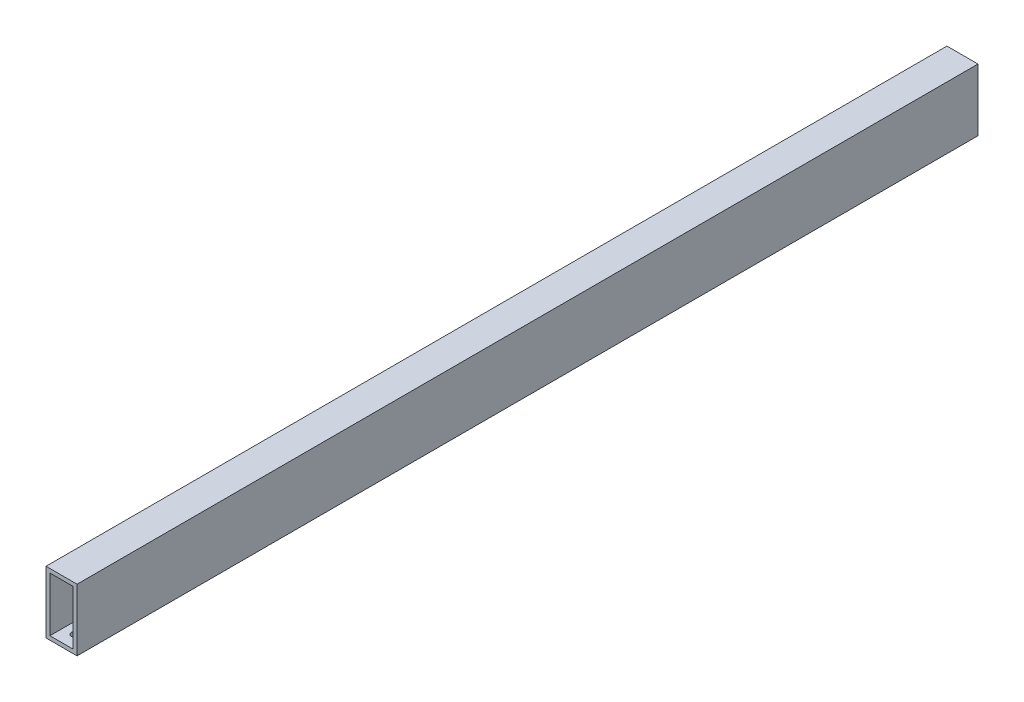
ISO-10303-21;
HEADER;
FILE_DESCRIPTION(('STEP AP214'),'2;1');
FILE_NAME('part.step','',(''),(''),'','','');
FILE_SCHEMA(('AUTOMOTIVE_DESIGN { 1 0 10303 214 1 1 1 1 }'));
ENDSEC;
DATA;
#1=APPLICATION_CONTEXT('core data for automotive mechanical design processes');
#2=APPLICATION_PROTOCOL_DEFINITION('international standard','automotive_design',2000,#1);
#3=PRODUCT_CONTEXT('',#1,'mechanical');
#4=PRODUCT('Part','Part','',(#3));
#5=PRODUCT_RELATED_PRODUCT_CATEGORY('part','',(#4));
#6=PRODUCT_DEFINITION_FORMATION('','',#4);
#7=PRODUCT_DEFINITION_CONTEXT('part definition',#1,'design');
#8=PRODUCT_DEFINITION('design','',#6,#7);
#9=PRODUCT_DEFINITION_SHAPE('','',#8);
#10=(LENGTH_UNIT() NAMED_UNIT(*) SI_UNIT(.MILLI.,.METRE.));
#11=(NAMED_UNIT(*) PLANE_ANGLE_UNIT() SI_UNIT($,.RADIAN.));
#12=(NAMED_UNIT(*) SI_UNIT($,.STERADIAN.) SOLID_ANGLE_UNIT());
#13=UNCERTAINTY_MEASURE_WITH_UNIT(LENGTH_MEASURE(1.E-05),#10,'distance_accuracy_value','');
#14=(GEOMETRIC_REPRESENTATION_CONTEXT(3) GLOBAL_UNCERTAINTY_ASSIGNED_CONTEXT((#13)) GLOBAL_UNIT_ASSIGNED_CONTEXT((#10,
#11,#12)) REPRESENTATION_CONTEXT('',''));
#15=CARTESIAN_POINT('',(0.,0.,0.));
#16=DIRECTION('',(0.,0.,1.));
#17=DIRECTION('',(1.,0.,0.));
#18=AXIS2_PLACEMENT_3D('',#15,#16,#17);
#19=CARTESIAN_POINT('',(0.,0.,736.6));
#20=DIRECTION('',(0.,1.,0.));
#21=DIRECTION('',(0.,0.,1.));
#22=AXIS2_PLACEMENT_3D('',#19,#20,#21);
#23=PLANE('',#22);
#24=CARTESIAN_POINT('',(12.6999999999997,0.,725.17));
#25=DIRECTION('',(0.,-1.,0.));
#26=DIRECTION('',(0.,0.,-1.));
#27=AXIS2_PLACEMENT_3D('',#24,#25,#26);
#28=CIRCLE('',#27,3.17500000000001);
#29=CARTESIAN_POINT('',(12.6999999999997,0.,721.995));
#30=VERTEX_POINT('',#29);
#31=EDGE_CURVE('E228',#30,#30,#28,.F.);
#32=ORIENTED_EDGE('',*,*,#31,.T.);
#33=EDGE_LOOP('',(#32));
#34=FACE_BOUND('',#33,.T.);
#35=CARTESIAN_POINT('',(12.6999999999997,0.,26.0582354721581));
#36=DIRECTION('',(0.,-1.,0.));
#37=DIRECTION('',(0.,0.,-1.));
#38=AXIS2_PLACEMENT_3D('',#35,#36,#37);
#39=CIRCLE('',#38,3.175);
#40=CARTESIAN_POINT('',(12.6999999999997,0.,22.8832354721581));
#41=VERTEX_POINT('',#40);
#42=EDGE_CURVE('E231',#41,#41,#39,.T.);
#43=ORIENTED_EDGE('',*,*,#42,.F.);
#44=EDGE_LOOP('',(#43));
#45=FACE_BOUND('',#44,.T.);
#46=CARTESIAN_POINT('',(12.6999999999997,0.,710.541764527842));
#47=DIRECTION('',(0.,-1.,0.));
#48=DIRECTION('',(0.,0.,-1.));
#49=AXIS2_PLACEMENT_3D('',#46,#47,#48);
#50=CIRCLE('',#49,3.175);
#51=CARTESIAN_POINT('',(12.6999999999997,0.,707.366764527841));
#52=VERTEX_POINT('',#51);
#53=EDGE_CURVE('E237',#52,#52,#50,.F.);
#54=ORIENTED_EDGE('',*,*,#53,.T.);
#55=EDGE_LOOP('',(#54));
#56=FACE_BOUND('',#55,.T.);
#57=DIRECTION('',(1.,0.,0.));
#58=VECTOR('',#57,1.);
#59=CARTESIAN_POINT('',(0.,0.,0.));
#60=LINE('',#59,#58);
#61=CARTESIAN_POINT('',(0.,0.,0.));
#62=VERTEX_POINT('',#61);
#63=CARTESIAN_POINT('',(25.4,0.,0.));
#64=VERTEX_POINT('',#63);
#65=EDGE_CURVE('E178',#62,#64,#60,.T.);
#66=ORIENTED_EDGE('',*,*,#65,.T.);
#67=DIRECTION('',(0.,0.,-1.));
#68=VECTOR('',#67,1.);
#69=CARTESIAN_POINT('',(25.4,0.,736.6));
#70=LINE('',#69,#68);
#71=CARTESIAN_POINT('',(25.4,0.,736.6));
#72=VERTEX_POINT('',#71);
#73=EDGE_CURVE('E51',#72,#64,#70,.T.);
#74=ORIENTED_EDGE('',*,*,#73,.F.);
#75=DIRECTION('',(1.,0.,0.));
#76=VECTOR('',#75,1.);
#77=CARTESIAN_POINT('',(0.,0.,736.6));
#78=LINE('',#77,#76);
#79=CARTESIAN_POINT('',(0.,0.,736.6));
#80=VERTEX_POINT('',#79);
#81=EDGE_CURVE('E164',#80,#72,#78,.T.);
#82=ORIENTED_EDGE('',*,*,#81,.F.);
#83=DIRECTION('',(0.,0.,-1.));
#84=VECTOR('',#83,1.);
#85=CARTESIAN_POINT('',(0.,0.,736.6));
#86=LINE('',#85,#84);
#87=EDGE_CURVE('E11',#80,#62,#86,.T.);
#88=ORIENTED_EDGE('',*,*,#87,.T.);
#89=EDGE_LOOP('',(#66,#74,#82,#88));
#90=FACE_BOUND('',#89,.T.);
#91=CARTESIAN_POINT('',(12.7000000000002,0.,11.4300000000001));
#92=DIRECTION('',(0.,-1.,0.));
#93=DIRECTION('',(0.,0.,-1.));
#94=AXIS2_PLACEMENT_3D('',#91,#92,#93);
#95=CIRCLE('',#94,3.17500000000001);
#96=CARTESIAN_POINT('',(12.7000000000002,0.,8.25500000000004));
#97=VERTEX_POINT('',#96);
#98=EDGE_CURVE('E220',#97,#97,#95,.T.);
#99=ORIENTED_EDGE('',*,*,#98,.F.);
#100=EDGE_LOOP('',(#99));
#101=FACE_BOUND('',#100,.T.);
#102=ADVANCED_FACE('F42',(#34,#45,#56,#90,#101),#23,.F.);
#103=CARTESIAN_POINT('',(3.175,3.175,736.6));
#104=DIRECTION('',(0.,1.,0.));
#105=DIRECTION('',(0.,0.,1.));
#106=AXIS2_PLACEMENT_3D('',#103,#104,#105);
#107=PLANE('',#106);
#108=CARTESIAN_POINT('',(12.6999999999997,3.175,725.17));
#109=DIRECTION('',(0.,1.,0.));
#110=DIRECTION('',(0.,0.,1.));
#111=AXIS2_PLACEMENT_3D('',#108,#109,#110);
#112=CIRCLE('',#111,3.17500000000001);
#113=CARTESIAN_POINT('',(12.6999999999997,3.175,728.345));
#114=VERTEX_POINT('',#113);
#115=EDGE_CURVE('E234',#114,#114,#112,.T.);
#116=ORIENTED_EDGE('',*,*,#115,.F.);
#117=EDGE_LOOP('',(#116));
#118=FACE_BOUND('',#117,.T.);
#119=CARTESIAN_POINT('',(12.6999999999997,3.175,710.541764527842));
#120=DIRECTION('',(0.,1.,0.));
#121=DIRECTION('',(0.,0.,1.));
#122=AXIS2_PLACEMENT_3D('',#119,#120,#121);
#123=CIRCLE('',#122,3.175);
#124=CARTESIAN_POINT('',(12.6999999999997,3.175,713.716764527842));
#125=VERTEX_POINT('',#124);
#126=EDGE_CURVE('E145',#125,#125,#123,.T.);
#127=ORIENTED_EDGE('',*,*,#126,.F.);
#128=EDGE_LOOP('',(#127));
#129=FACE_BOUND('',#128,.T.);
#130=DIRECTION('',(1.,0.,0.));
#131=VECTOR('',#130,1.);
#132=CARTESIAN_POINT('',(3.175,3.175,0.));
#133=LINE('',#132,#131);
#134=CARTESIAN_POINT('',(3.175,3.175,0.));
#135=VERTEX_POINT('',#134);
#136=CARTESIAN_POINT('',(22.225,3.175,0.));
#137=VERTEX_POINT('',#136);
#138=EDGE_CURVE('E66',#135,#137,#133,.T.);
#139=ORIENTED_EDGE('',*,*,#138,.F.);
#140=DIRECTION('',(0.,0.,-1.));
#141=VECTOR('',#140,1.);
#142=CARTESIAN_POINT('',(3.175,3.175,736.6));
#143=LINE('',#142,#141);
#144=CARTESIAN_POINT('',(3.175,3.175,736.6));
#145=VERTEX_POINT('',#144);
#146=EDGE_CURVE('E113',#145,#135,#143,.T.);
#147=ORIENTED_EDGE('',*,*,#146,.F.);
#148=DIRECTION('',(1.,0.,0.));
#149=VECTOR('',#148,1.);
#150=CARTESIAN_POINT('',(3.175,3.175,736.6));
#151=LINE('',#150,#149);
#152=CARTESIAN_POINT('',(22.225,3.175,736.6));
#153=VERTEX_POINT('',#152);
#154=EDGE_CURVE('E108',#145,#153,#151,.T.);
#155=ORIENTED_EDGE('',*,*,#154,.T.);
#156=DIRECTION('',(0.,0.,-1.));
#157=VECTOR('',#156,1.);
#158=CARTESIAN_POINT('',(22.225,3.175,736.6));
#159=LINE('',#158,#157);
#160=EDGE_CURVE('E112',#153,#137,#159,.T.);
#161=ORIENTED_EDGE('',*,*,#160,.T.);
#162=EDGE_LOOP('',(#139,#147,#155,#161));
#163=FACE_BOUND('',#162,.T.);
#164=CARTESIAN_POINT('',(12.6999999999997,3.175,26.0582354721581));
#165=DIRECTION('',(0.,1.,0.));
#166=DIRECTION('',(0.,0.,1.));
#167=AXIS2_PLACEMENT_3D('',#164,#165,#166);
#168=CIRCLE('',#167,3.175);
#169=CARTESIAN_POINT('',(12.6999999999997,3.175,29.2332354721581));
#170=VERTEX_POINT('',#169);
#171=EDGE_CURVE('E224',#170,#170,#168,.F.);
#172=ORIENTED_EDGE('',*,*,#171,.T.);
#173=EDGE_LOOP('',(#172));
#174=FACE_BOUND('',#173,.T.);
#175=CARTESIAN_POINT('',(12.7000000000002,3.175,11.4300000000001));
#176=DIRECTION('',(0.,1.,0.));
#177=DIRECTION('',(0.,0.,1.));
#178=AXIS2_PLACEMENT_3D('',#175,#176,#177);
#179=CIRCLE('',#178,3.17500000000001);
#180=CARTESIAN_POINT('',(12.7000000000002,3.175,14.6050000000001));
#181=VERTEX_POINT('',#180);
#182=EDGE_CURVE('E223',#181,#181,#179,.F.);
#183=ORIENTED_EDGE('',*,*,#182,.T.);
#184=EDGE_LOOP('',(#183));
#185=FACE_BOUND('',#184,.T.);
#186=ADVANCED_FACE('F110',(#118,#129,#163,#174,#185),#107,.T.);
#187=CARTESIAN_POINT('',(0.,0.,736.6));
#188=DIRECTION('',(0.,0.,-1.));
#189=DIRECTION('',(-1.,0.,0.));
#190=AXIS2_PLACEMENT_3D('',#187,#188,#189);
#191=PLANE('',#190);
#192=DIRECTION('',(0.,-1.,0.));
#193=VECTOR('',#192,1.);
#194=CARTESIAN_POINT('',(0.,0.,736.6));
#195=LINE('',#194,#193);
#196=CARTESIAN_POINT('',(0.,50.8,736.6));
#197=VERTEX_POINT('',#196);
#198=EDGE_CURVE('E160',#197,#80,#195,.T.);
#199=ORIENTED_EDGE('',*,*,#198,.T.);
#200=ORIENTED_EDGE('',*,*,#81,.T.);
#201=DIRECTION('',(0.,1.,0.));
#202=VECTOR('',#201,1.);
#203=CARTESIAN_POINT('',(25.4,0.,736.6));
#204=LINE('',#203,#202);
#205=CARTESIAN_POINT('',(25.4,50.8,736.6));
#206=VERTEX_POINT('',#205);
#207=EDGE_CURVE('E168',#72,#206,#204,.T.);
#208=ORIENTED_EDGE('',*,*,#207,.T.);
#209=DIRECTION('',(-1.,0.,0.));
#210=VECTOR('',#209,1.);
#211=CARTESIAN_POINT('',(0.,50.8,736.6));
#212=LINE('',#211,#210);
#213=EDGE_CURVE('E171',#206,#197,#212,.T.);
#214=ORIENTED_EDGE('',*,*,#213,.T.);
#215=EDGE_LOOP('',(#199,#200,#208,#214));
#216=FACE_BOUND('',#215,.T.);
#217=ORIENTED_EDGE('',*,*,#154,.F.);
#218=DIRECTION('',(0.,-1.,0.));
#219=VECTOR('',#218,1.);
#220=CARTESIAN_POINT('',(3.175,3.175,736.6));
#221=LINE('',#220,#219);
#222=CARTESIAN_POINT('',(3.175,47.625,736.6));
#223=VERTEX_POINT('',#222);
#224=EDGE_CURVE('E138',#223,#145,#221,.T.);
#225=ORIENTED_EDGE('',*,*,#224,.F.);
#226=DIRECTION('',(-1.,0.,0.));
#227=VECTOR('',#226,1.);
#228=CARTESIAN_POINT('',(3.175,47.625,736.6));
#229=LINE('',#228,#227);
#230=CARTESIAN_POINT('',(22.225,47.625,736.6));
#231=VERTEX_POINT('',#230);
#232=EDGE_CURVE('E132',#231,#223,#229,.T.);
#233=ORIENTED_EDGE('',*,*,#232,.F.);
#234=DIRECTION('',(0.,1.,0.));
#235=VECTOR('',#234,1.);
#236=CARTESIAN_POINT('',(22.225,3.175,736.6));
#237=LINE('',#236,#235);
#238=EDGE_CURVE('E118',#153,#231,#237,.T.);
#239=ORIENTED_EDGE('',*,*,#238,.F.);
#240=EDGE_LOOP('',(#217,#225,#233,#239));
#241=FACE_BOUND('',#240,.T.);
#242=ADVANCED_FACE('F131',(#216,#241),#191,.F.);
#243=CARTESIAN_POINT('',(0.,0.,0.));
#244=DIRECTION('',(0.,0.,-1.));
#245=DIRECTION('',(-1.,0.,0.));
#246=AXIS2_PLACEMENT_3D('',#243,#244,#245);
#247=PLANE('',#246);
#248=DIRECTION('',(0.,-1.,0.));
#249=VECTOR('',#248,1.);
#250=CARTESIAN_POINT('',(0.,0.,0.));
#251=LINE('',#250,#249);
#252=CARTESIAN_POINT('',(0.,50.8,0.));
#253=VERTEX_POINT('',#252);
#254=EDGE_CURVE('E127',#253,#62,#251,.T.);
#255=ORIENTED_EDGE('',*,*,#254,.F.);
#256=DIRECTION('',(-1.,0.,0.));
#257=VECTOR('',#256,1.);
#258=CARTESIAN_POINT('',(0.,50.8,0.));
#259=LINE('',#258,#257);
#260=CARTESIAN_POINT('',(25.4,50.8,0.));
#261=VERTEX_POINT('',#260);
#262=EDGE_CURVE('E165',#261,#253,#259,.T.);
#263=ORIENTED_EDGE('',*,*,#262,.F.);
#264=DIRECTION('',(0.,1.,0.));
#265=VECTOR('',#264,1.);
#266=CARTESIAN_POINT('',(25.4,0.,0.));
#267=LINE('',#266,#265);
#268=EDGE_CURVE('E181',#64,#261,#267,.T.);
#269=ORIENTED_EDGE('',*,*,#268,.F.);
#270=ORIENTED_EDGE('',*,*,#65,.F.);
#271=EDGE_LOOP('',(#255,#263,#269,#270));
#272=FACE_BOUND('',#271,.T.);
#273=DIRECTION('',(0.,-1.,0.));
#274=VECTOR('',#273,1.);
#275=CARTESIAN_POINT('',(3.175,3.175,0.));
#276=LINE('',#275,#274);
#277=CARTESIAN_POINT('',(3.175,47.625,0.));
#278=VERTEX_POINT('',#277);
#279=EDGE_CURVE('E119',#278,#135,#276,.T.);
#280=ORIENTED_EDGE('',*,*,#279,.T.);
#281=ORIENTED_EDGE('',*,*,#138,.T.);
#282=DIRECTION('',(0.,1.,0.));
#283=VECTOR('',#282,1.);
#284=CARTESIAN_POINT('',(22.225,3.175,0.));
#285=LINE('',#284,#283);
#286=CARTESIAN_POINT('',(22.225,47.625,0.));
#287=VERTEX_POINT('',#286);
#288=EDGE_CURVE('E125',#137,#287,#285,.T.);
#289=ORIENTED_EDGE('',*,*,#288,.T.);
#290=DIRECTION('',(-1.,0.,0.));
#291=VECTOR('',#290,1.);
#292=CARTESIAN_POINT('',(3.175,47.625,0.));
#293=LINE('',#292,#291);
#294=EDGE_CURVE('E148',#287,#278,#293,.T.);
#295=ORIENTED_EDGE('',*,*,#294,.T.);
#296=EDGE_LOOP('',(#280,#281,#289,#295));
#297=FACE_BOUND('',#296,.T.);
#298=ADVANCED_FACE('F205',(#272,#297),#247,.T.);
#299=CARTESIAN_POINT('',(0.,0.,736.6));
#300=DIRECTION('',(1.,0.,0.));
#301=DIRECTION('',(0.,0.,-1.));
#302=AXIS2_PLACEMENT_3D('',#299,#300,#301);
#303=PLANE('',#302);
#304=ORIENTED_EDGE('',*,*,#254,.T.);
#305=ORIENTED_EDGE('',*,*,#87,.F.);
#306=ORIENTED_EDGE('',*,*,#198,.F.);
#307=DIRECTION('',(0.,0.,-1.));
#308=VECTOR('',#307,1.);
#309=CARTESIAN_POINT('',(0.,50.8,736.6));
#310=LINE('',#309,#308);
#311=EDGE_CURVE('E174',#197,#253,#310,.T.);
#312=ORIENTED_EDGE('',*,*,#311,.T.);
#313=EDGE_LOOP('',(#304,#305,#306,#312));
#314=FACE_BOUND('',#313,.T.);
#315=ADVANCED_FACE('F44',(#314),#303,.F.);
#316=CARTESIAN_POINT('',(25.4,0.,736.6));
#317=DIRECTION('',(-1.,0.,0.));
#318=DIRECTION('',(0.,0.,1.));
#319=AXIS2_PLACEMENT_3D('',#316,#317,#318);
#320=PLANE('',#319);
#321=ORIENTED_EDGE('',*,*,#268,.T.);
#322=DIRECTION('',(0.,0.,-1.));
#323=VECTOR('',#322,1.);
#324=CARTESIAN_POINT('',(25.4,50.8,736.6));
#325=LINE('',#324,#323);
#326=EDGE_CURVE('E189',#206,#261,#325,.T.);
#327=ORIENTED_EDGE('',*,*,#326,.F.);
#328=ORIENTED_EDGE('',*,*,#207,.F.);
#329=ORIENTED_EDGE('',*,*,#73,.T.);
#330=EDGE_LOOP('',(#321,#327,#328,#329));
#331=FACE_BOUND('',#330,.T.);
#332=ADVANCED_FACE('F199',(#331),#320,.F.);
#333=CARTESIAN_POINT('',(0.,50.8,736.6));
#334=DIRECTION('',(0.,-1.,0.));
#335=DIRECTION('',(0.,0.,-1.));
#336=AXIS2_PLACEMENT_3D('',#333,#334,#335);
#337=PLANE('',#336);
#338=ORIENTED_EDGE('',*,*,#262,.T.);
#339=ORIENTED_EDGE('',*,*,#311,.F.);
#340=ORIENTED_EDGE('',*,*,#213,.F.);
#341=ORIENTED_EDGE('',*,*,#326,.T.);
#342=EDGE_LOOP('',(#338,#339,#340,#341));
#343=FACE_BOUND('',#342,.T.);
#344=ADVANCED_FACE('F209',(#343),#337,.F.);
#345=CARTESIAN_POINT('',(22.225,3.175,736.6));
#346=DIRECTION('',(-1.,0.,0.));
#347=DIRECTION('',(0.,0.,1.));
#348=AXIS2_PLACEMENT_3D('',#345,#346,#347);
#349=PLANE('',#348);
#350=ORIENTED_EDGE('',*,*,#288,.F.);
#351=ORIENTED_EDGE('',*,*,#160,.F.);
#352=ORIENTED_EDGE('',*,*,#238,.T.);
#353=DIRECTION('',(0.,0.,-1.));
#354=VECTOR('',#353,1.);
#355=CARTESIAN_POINT('',(22.225,47.625,736.6));
#356=LINE('',#355,#354);
#357=EDGE_CURVE('E128',#231,#287,#356,.T.);
#358=ORIENTED_EDGE('',*,*,#357,.T.);
#359=EDGE_LOOP('',(#350,#351,#352,#358));
#360=FACE_BOUND('',#359,.T.);
#361=ADVANCED_FACE('F122',(#360),#349,.T.);
#362=CARTESIAN_POINT('',(3.175,47.625,736.6));
#363=DIRECTION('',(0.,-1.,0.));
#364=DIRECTION('',(0.,0.,-1.));
#365=AXIS2_PLACEMENT_3D('',#362,#363,#364);
#366=PLANE('',#365);
#367=ORIENTED_EDGE('',*,*,#294,.F.);
#368=ORIENTED_EDGE('',*,*,#357,.F.);
#369=ORIENTED_EDGE('',*,*,#232,.T.);
#370=DIRECTION('',(0.,0.,-1.));
#371=VECTOR('',#370,1.);
#372=CARTESIAN_POINT('',(3.175,47.625,736.6));
#373=LINE('',#372,#371);
#374=EDGE_CURVE('E58',#223,#278,#373,.T.);
#375=ORIENTED_EDGE('',*,*,#374,.T.);
#376=EDGE_LOOP('',(#367,#368,#369,#375));
#377=FACE_BOUND('',#376,.T.);
#378=ADVANCED_FACE('F296',(#377),#366,.T.);
#379=CARTESIAN_POINT('',(3.175,3.175,736.6));
#380=DIRECTION('',(1.,0.,0.));
#381=DIRECTION('',(0.,0.,-1.));
#382=AXIS2_PLACEMENT_3D('',#379,#380,#381);
#383=PLANE('',#382);
#384=ORIENTED_EDGE('',*,*,#279,.F.);
#385=ORIENTED_EDGE('',*,*,#374,.F.);
#386=ORIENTED_EDGE('',*,*,#224,.T.);
#387=ORIENTED_EDGE('',*,*,#146,.T.);
#388=EDGE_LOOP('',(#384,#385,#386,#387));
#389=FACE_BOUND('',#388,.T.);
#390=ADVANCED_FACE('F290',(#389),#383,.T.);
#391=CARTESIAN_POINT('',(12.6999999999997,12.1552561210692,710.541764527842));
#392=DIRECTION('',(0.,-1.,0.));
#393=DIRECTION('',(0.,0.,-1.));
#394=AXIS2_PLACEMENT_3D('',#391,#392,#393);
#395=CYLINDRICAL_SURFACE('',#394,3.175);
#396=ORIENTED_EDGE('',*,*,#53,.F.);
#397=EDGE_LOOP('',(#396));
#398=FACE_BOUND('',#397,.T.);
#399=ORIENTED_EDGE('',*,*,#126,.T.);
#400=EDGE_LOOP('',(#399));
#401=FACE_BOUND('',#400,.T.);
#402=ADVANCED_FACE('F245',(#398,#401),#395,.F.);
#403=CARTESIAN_POINT('',(12.6999999999997,12.1552561210692,26.0582354721581));
#404=DIRECTION('',(0.,-1.,0.));
#405=DIRECTION('',(0.,0.,-1.));
#406=AXIS2_PLACEMENT_3D('',#403,#404,#405);
#407=CYLINDRICAL_SURFACE('',#406,3.175);
#408=ORIENTED_EDGE('',*,*,#42,.T.);
#409=EDGE_LOOP('',(#408));
#410=FACE_BOUND('',#409,.T.);
#411=ORIENTED_EDGE('',*,*,#171,.F.);
#412=EDGE_LOOP('',(#411));
#413=FACE_BOUND('',#412,.T.);
#414=ADVANCED_FACE('F343',(#410,#413),#407,.F.);
#415=CARTESIAN_POINT('',(12.7000000000002,12.1552561210692,11.4300000000001));
#416=DIRECTION('',(0.,-1.,0.));
#417=DIRECTION('',(0.,0.,-1.));
#418=AXIS2_PLACEMENT_3D('',#415,#416,#417);
#419=CYLINDRICAL_SURFACE('',#418,3.17500000000001);
#420=ORIENTED_EDGE('',*,*,#98,.T.);
#421=EDGE_LOOP('',(#420));
#422=FACE_BOUND('',#421,.T.);
#423=ORIENTED_EDGE('',*,*,#182,.F.);
#424=EDGE_LOOP('',(#423));
#425=FACE_BOUND('',#424,.T.);
#426=ADVANCED_FACE('F349',(#422,#425),#419,.F.);
#427=CARTESIAN_POINT('',(12.6999999999997,12.1552561210692,725.17));
#428=DIRECTION('',(0.,-1.,0.));
#429=DIRECTION('',(0.,0.,-1.));
#430=AXIS2_PLACEMENT_3D('',#427,#428,#429);
#431=CYLINDRICAL_SURFACE('',#430,3.17500000000001);
#432=ORIENTED_EDGE('',*,*,#31,.F.);
#433=EDGE_LOOP('',(#432));
#434=FACE_BOUND('',#433,.T.);
#435=ORIENTED_EDGE('',*,*,#115,.T.);
#436=EDGE_LOOP('',(#435));
#437=FACE_BOUND('',#436,.T.);
#438=ADVANCED_FACE('F356',(#434,#437),#431,.F.);
#439=CLOSED_SHELL('',(#102,#186,#242,#298,#315,#332,#344,#361,#378,#390,#402,#414,#426,#438));
#440=MANIFOLD_SOLID_BREP('B2',#439);
#441=ADVANCED_BREP_SHAPE_REPRESENTATION('',(#18,#440),#14);
#442=SHAPE_DEFINITION_REPRESENTATION(#9,#441);
ENDSEC;
END-ISO-10303-21;
